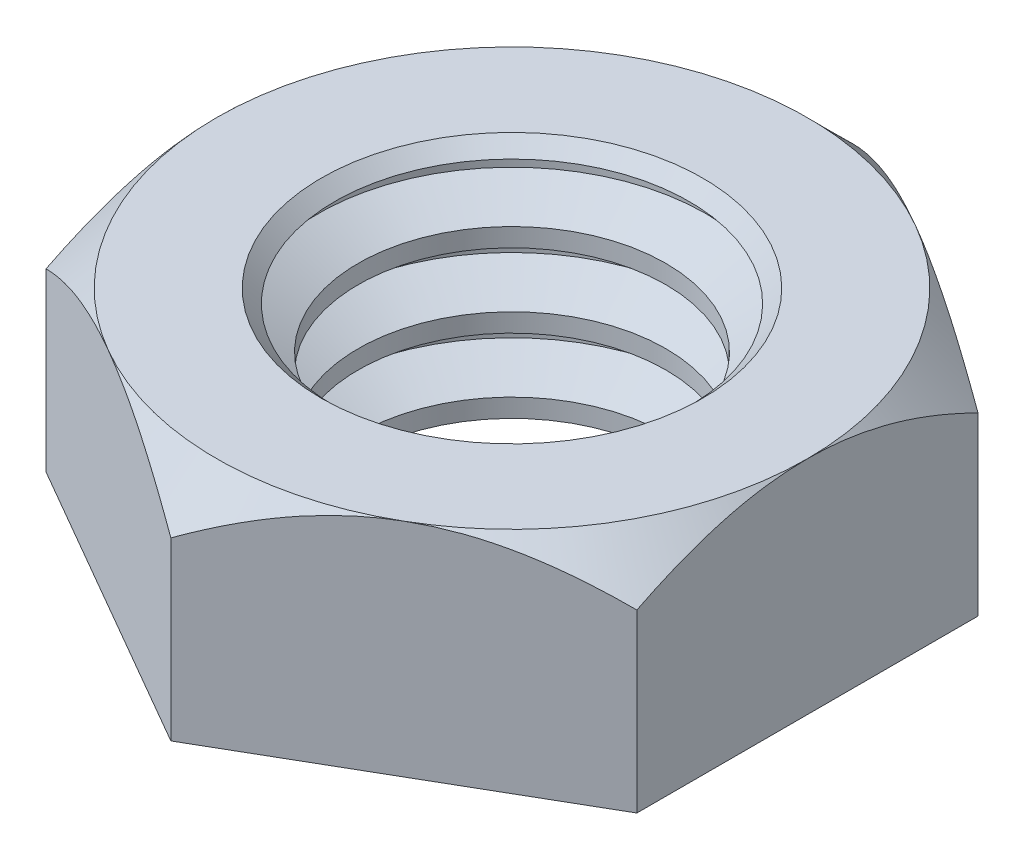
ISO-10303-21;
HEADER;
FILE_DESCRIPTION(('STEP AP214'),'2;1');
FILE_NAME('part.step','',(''),(''),'','','');
FILE_SCHEMA(('AUTOMOTIVE_DESIGN { 1 0 10303 214 1 1 1 1 }'));
ENDSEC;
DATA;
#1=APPLICATION_CONTEXT('core data for automotive mechanical design processes');
#2=APPLICATION_PROTOCOL_DEFINITION('international standard','automotive_design',2000,#1);
#3=PRODUCT_CONTEXT('',#1,'mechanical');
#4=PRODUCT('Part','Part','',(#3));
#5=PRODUCT_RELATED_PRODUCT_CATEGORY('part','',(#4));
#6=PRODUCT_DEFINITION_FORMATION('','',#4);
#7=PRODUCT_DEFINITION_CONTEXT('part definition',#1,'design');
#8=PRODUCT_DEFINITION('design','',#6,#7);
#9=PRODUCT_DEFINITION_SHAPE('','',#8);
#10=(LENGTH_UNIT() NAMED_UNIT(*) SI_UNIT(.MILLI.,.METRE.));
#11=(NAMED_UNIT(*) PLANE_ANGLE_UNIT() SI_UNIT($,.RADIAN.));
#12=(NAMED_UNIT(*) SI_UNIT($,.STERADIAN.) SOLID_ANGLE_UNIT());
#13=UNCERTAINTY_MEASURE_WITH_UNIT(LENGTH_MEASURE(1.E-05),#10,'distance_accuracy_value','');
#14=(GEOMETRIC_REPRESENTATION_CONTEXT(3) GLOBAL_UNCERTAINTY_ASSIGNED_CONTEXT((#13)) GLOBAL_UNIT_ASSIGNED_CONTEXT((#10,
#11,#12)) REPRESENTATION_CONTEXT('',''));
#15=CARTESIAN_POINT('',(0.,0.,0.));
#16=DIRECTION('',(0.,0.,1.));
#17=DIRECTION('',(1.,0.,0.));
#18=AXIS2_PLACEMENT_3D('',#15,#16,#17);
#19=CARTESIAN_POINT('',(-3.175,0.,-5.49926131403119));
#20=DIRECTION('',(0.,1.,0.));
#21=DIRECTION('',(0.,0.,1.));
#22=AXIS2_PLACEMENT_3D('',#19,#20,#21);
#23=PLANE('',#22);
#24=DIRECTION('',(-0.866025403784439,0.,-0.5));
#25=VECTOR('',#24,1.);
#26=CARTESIAN_POINT('',(3.175,0.,-1.83308710467706));
#27=LINE('',#26,#25);
#28=CARTESIAN_POINT('',(3.175,0.,-1.83308710467706));
#29=VERTEX_POINT('',#28);
#30=CARTESIAN_POINT('',(0.,0.,-3.66617420935412));
#31=VERTEX_POINT('',#30);
#32=EDGE_CURVE('E208',#29,#31,#27,.T.);
#33=ORIENTED_EDGE('',*,*,#32,.F.);
#34=DIRECTION('',(0.,0.,-1.));
#35=VECTOR('',#34,1.);
#36=CARTESIAN_POINT('',(3.175,0.,1.83308710467706));
#37=LINE('',#36,#35);
#38=CARTESIAN_POINT('',(3.175,0.,1.83308710467706));
#39=VERTEX_POINT('',#38);
#40=EDGE_CURVE('E282',#39,#29,#37,.T.);
#41=ORIENTED_EDGE('',*,*,#40,.F.);
#42=DIRECTION('',(0.866025403784439,0.,-0.5));
#43=VECTOR('',#42,1.);
#44=CARTESIAN_POINT('',(0.,0.,3.66617420935412));
#45=LINE('',#44,#43);
#46=CARTESIAN_POINT('',(0.,0.,3.66617420935412));
#47=VERTEX_POINT('',#46);
#48=EDGE_CURVE('E280',#47,#39,#45,.T.);
#49=ORIENTED_EDGE('',*,*,#48,.F.);
#50=DIRECTION('',(0.866025403784439,0.,0.5));
#51=VECTOR('',#50,1.);
#52=CARTESIAN_POINT('',(-3.175,0.,1.83308710467706));
#53=LINE('',#52,#51);
#54=CARTESIAN_POINT('',(-3.175,0.,1.83308710467706));
#55=VERTEX_POINT('',#54);
#56=EDGE_CURVE('E126',#55,#47,#53,.T.);
#57=ORIENTED_EDGE('',*,*,#56,.F.);
#58=DIRECTION('',(0.,0.,1.));
#59=VECTOR('',#58,1.);
#60=CARTESIAN_POINT('',(-3.175,0.,-1.83308710467706));
#61=LINE('',#60,#59);
#62=CARTESIAN_POINT('',(-3.175,0.,-1.83308710467706));
#63=VERTEX_POINT('',#62);
#64=EDGE_CURVE('E276',#63,#55,#61,.T.);
#65=ORIENTED_EDGE('',*,*,#64,.F.);
#66=DIRECTION('',(-0.866025403784439,0.,0.5));
#67=VECTOR('',#66,1.);
#68=CARTESIAN_POINT('',(0.,0.,-3.66617420935412));
#69=LINE('',#68,#67);
#70=EDGE_CURVE('E273',#31,#63,#69,.T.);
#71=ORIENTED_EDGE('',*,*,#70,.F.);
#72=EDGE_LOOP('',(#33,#41,#49,#57,#65,#71));
#73=FACE_BOUND('',#72,.T.);
#74=CARTESIAN_POINT('',(0.,0.,0.));
#75=DIRECTION('',(0.,1.,0.));
#76=DIRECTION('',(0.,0.,1.));
#77=AXIS2_PLACEMENT_3D('',#74,#75,#76);
#78=CIRCLE('',#77,1.65317020984131);
#79=CARTESIAN_POINT('',(0.,0.,1.65317020984131));
#80=VERTEX_POINT('',#79);
#81=EDGE_CURVE('E211',#80,#80,#78,.T.);
#82=ORIENTED_EDGE('',*,*,#81,.T.);
#83=EDGE_LOOP('',(#82));
#84=FACE_BOUND('',#83,.T.);
#85=ADVANCED_FACE('F31',(#73,#84),#23,.F.);
#86=CARTESIAN_POINT('',(-3.175,2.38125,-5.49926131403119));
#87=DIRECTION('',(0.,1.,0.));
#88=DIRECTION('',(0.,0.,1.));
#89=AXIS2_PLACEMENT_3D('',#86,#87,#88);
#90=PLANE('',#89);
#91=CARTESIAN_POINT('',(0.,2.38125,0.));
#92=DIRECTION('',(0.,1.,0.));
#93=DIRECTION('',(0.,0.,1.));
#94=AXIS2_PLACEMENT_3D('',#91,#92,#93);
#95=CIRCLE('',#94,2.05004520984131);
#96=CARTESIAN_POINT('',(0.,2.38125,2.05004520984131));
#97=VERTEX_POINT('',#96);
#98=EDGE_CURVE('E11',#97,#97,#95,.F.);
#99=ORIENTED_EDGE('',*,*,#98,.T.);
#100=EDGE_LOOP('',(#99));
#101=FACE_BOUND('',#100,.T.);
#102=CARTESIAN_POINT('',(0.,2.38125,0.));
#103=DIRECTION('',(0.,1.,0.));
#104=DIRECTION('',(0.,0.,1.));
#105=AXIS2_PLACEMENT_3D('',#102,#103,#104);
#106=CIRCLE('',#105,3.175);
#107=CARTESIAN_POINT('',(-1.5875,2.38125,2.74963065701559));
#108=VERTEX_POINT('',#107);
#109=CARTESIAN_POINT('',(1.5875,2.38125,2.74963065701559));
#110=VERTEX_POINT('',#109);
#111=EDGE_CURVE('E110',#108,#110,#106,.T.);
#112=ORIENTED_EDGE('',*,*,#111,.T.);
#113=CARTESIAN_POINT('',(3.175,2.38125,0.));
#114=VERTEX_POINT('',#113);
#115=EDGE_CURVE('E167',#110,#114,#106,.T.);
#116=ORIENTED_EDGE('',*,*,#115,.T.);
#117=CARTESIAN_POINT('',(1.5875,2.38125,-2.74963065701559));
#118=VERTEX_POINT('',#117);
#119=EDGE_CURVE('E250',#114,#118,#106,.T.);
#120=ORIENTED_EDGE('',*,*,#119,.T.);
#121=CARTESIAN_POINT('',(-1.5875,2.38125,-2.74963065701559));
#122=VERTEX_POINT('',#121);
#123=EDGE_CURVE('E252',#118,#122,#106,.T.);
#124=ORIENTED_EDGE('',*,*,#123,.T.);
#125=CARTESIAN_POINT('',(-3.175,2.38125,0.));
#126=VERTEX_POINT('',#125);
#127=EDGE_CURVE('E47',#122,#126,#106,.T.);
#128=ORIENTED_EDGE('',*,*,#127,.T.);
#129=EDGE_CURVE('E55',#126,#108,#106,.T.);
#130=ORIENTED_EDGE('',*,*,#129,.T.);
#131=EDGE_LOOP('',(#112,#116,#120,#124,#128,#130));
#132=FACE_BOUND('',#131,.T.);
#133=ADVANCED_FACE('F157',(#101,#132),#90,.T.);
#134=CARTESIAN_POINT('',(3.175,2.38125,-1.83308710467706));
#135=DIRECTION('',(-0.5,0.,0.866025403784439));
#136=DIRECTION('',(0.866025403784439,0.,0.5));
#137=AXIS2_PLACEMENT_3D('',#134,#135,#136);
#138=PLANE('',#137);
#139=CARTESIAN_POINT('',(3.1752,1.88996031513694,-1.83297163462322));
#140=CARTESIAN_POINT('',(3.06606165005017,1.9529168069541,-1.89598269034567));
#141=CARTESIAN_POINT('',(2.95509837192205,2.01217568641114,-1.9600473688431));
#142=CARTESIAN_POINT('',(2.72883215365405,2.12067713491532,-2.09068223086865));
#143=CARTESIAN_POINT('',(2.61350769674773,2.16985933670717,-2.15726483710766));
#144=CARTESIAN_POINT('',(2.38096147751937,2.25410933177188,-2.29152545937819));
#145=CARTESIAN_POINT('',(2.26379893371884,2.28938887614643,-2.35916928558036));
#146=CARTESIAN_POINT('',(2.02689455535371,2.34374422051106,-2.49594609220167));
#147=CARTESIAN_POINT('',(1.90715995735644,2.36286059311624,-2.56507489458671));
#148=CARTESIAN_POINT('',(1.70080208124841,2.38010866002263,-2.68421566990708));
#149=CARTESIAN_POINT('',(1.61444529227083,2.38266185703206,-2.73407378526963));
#150=CARTESIAN_POINT('',(1.44187218347527,2.37835951752261,-2.83370891608764));
#151=CARTESIAN_POINT('',(1.35565592350718,2.37150068262443,-2.88348589698874));
#152=CARTESIAN_POINT('',(1.18404020841286,2.34876590734217,-2.98256827629562));
#153=CARTESIAN_POINT('',(1.09864177574671,2.3328798809586,-3.03187308438379));
#154=CARTESIAN_POINT('',(0.929311596694508,2.29295780664792,-3.12963590884151));
#155=CARTESIAN_POINT('',(0.845379738380232,2.2689223835607,-3.17809398983284));
#156=CARTESIAN_POINT('',(0.696376420715866,2.21947055622871,-3.26412109539651));
#157=CARTESIAN_POINT('',(0.63097514880825,2.19535407134489,-3.30188053733772));
#158=CARTESIAN_POINT('',(0.501346749794879,2.14323432350872,-3.37672152840271));
#159=CARTESIAN_POINT('',(0.437119658558264,2.11523094204235,-3.41380305681743));
#160=CARTESIAN_POINT('',(0.310041965487391,2.05596522510137,-3.4871713971199));
#161=CARTESIAN_POINT('',(0.247187749251269,2.02471313729167,-3.52346029578353));
#162=CARTESIAN_POINT('',(0.122643379151903,1.95936044625395,-3.59536602138645));
#163=CARTESIAN_POINT('',(0.0609525390212882,1.92526159112734,-3.63098324454239));
#164=CARTESIAN_POINT('',(-0.000200000000000332,1.88996031513694,-3.66628967940796));
#165=B_SPLINE_CURVE_WITH_KNOTS('',3,(#139,#140,#141,#142,#143,#144,#145,#146,#147,#148,#149,
#150,#151,#152,#153,#154,#155,#156,#157,#158,#159,#160,#161,#162,#163,#164),.UNSPECIFIED.,.F.,
.F.,(4,2,2,2,2,2,2,2,2,2,2,2,4),(0.,0.422910572436811,0.848285055427813,1.26690402276128,
1.68446903107507,1.98329272958353,2.28222117546892,2.58148426995467,2.88072442418454,
3.11844134429548,3.35616551414406,3.59316134346767,3.83001269744429),.UNSPECIFIED.);
#166=CARTESIAN_POINT('',(3.175,1.89007579064588,-1.83308710467706));
#167=VERTEX_POINT('',#166);
#168=EDGE_CURVE('E264',#167,#118,#165,.T.);
#169=ORIENTED_EDGE('',*,*,#168,.F.);
#170=DIRECTION('',(0.,-1.,0.));
#171=VECTOR('',#170,1.);
#172=CARTESIAN_POINT('',(3.175,2.38125,-1.83308710467706));
#173=LINE('',#172,#171);
#174=EDGE_CURVE('E133',#167,#29,#173,.T.);
#175=ORIENTED_EDGE('',*,*,#174,.T.);
#176=ORIENTED_EDGE('',*,*,#32,.T.);
#177=DIRECTION('',(0.,-1.,0.));
#178=VECTOR('',#177,1.);
#179=CARTESIAN_POINT('',(0.,2.38125,-3.66617420935412));
#180=LINE('',#179,#178);
#181=CARTESIAN_POINT('',(0.,1.89007579064588,-3.66617420935412));
#182=VERTEX_POINT('',#181);
#183=EDGE_CURVE('E138',#182,#31,#180,.T.);
#184=ORIENTED_EDGE('',*,*,#183,.F.);
#185=EDGE_CURVE('E259',#118,#182,#165,.T.);
#186=ORIENTED_EDGE('',*,*,#185,.F.);
#187=EDGE_LOOP('',(#169,#175,#176,#184,#186));
#188=FACE_BOUND('',#187,.T.);
#189=ADVANCED_FACE('F33',(#188),#138,.F.);
#190=CARTESIAN_POINT('',(0.,2.38125,-3.66617420935412));
#191=DIRECTION('',(0.5,0.,0.866025403784439));
#192=DIRECTION('',(0.866025403784439,0.,-0.5));
#193=AXIS2_PLACEMENT_3D('',#190,#191,#192);
#194=PLANE('',#193);
#195=CARTESIAN_POINT('',(0.000199999999999625,1.88996031513694,-3.66628967940796));
#196=CARTESIAN_POINT('',(-0.108938349949827,1.9529168069541,-3.60327862368552));
#197=CARTESIAN_POINT('',(-0.219901628077947,2.01217568641114,-3.53921394518808));
#198=CARTESIAN_POINT('',(-0.446167846345949,2.12067713491532,-3.40857908316253));
#199=CARTESIAN_POINT('',(-0.561492303252266,2.16985933670717,-3.34199647692353));
#200=CARTESIAN_POINT('',(-0.79403852248063,2.25410933177188,-3.207735854653));
#201=CARTESIAN_POINT('',(-0.911201066281155,2.28938887614643,-3.14009202845083));
#202=CARTESIAN_POINT('',(-1.14810544464629,2.34374422051106,-3.00331522182952));
#203=CARTESIAN_POINT('',(-1.26784004264356,2.36286059311624,-2.93418641944448));
#204=CARTESIAN_POINT('',(-1.47419791875159,2.38010866002263,-2.81504564412411));
#205=CARTESIAN_POINT('',(-1.56055470772916,2.38266185703206,-2.76518752876155));
#206=CARTESIAN_POINT('',(-1.73312781652473,2.37835951752261,-2.66555239794355));
#207=CARTESIAN_POINT('',(-1.81934407649282,2.37150068262443,-2.61577541704245));
#208=CARTESIAN_POINT('',(-1.99095979158714,2.34876590734217,-2.51669303773557));
#209=CARTESIAN_POINT('',(-2.07635822425329,2.3328798809586,-2.4673882296474));
#210=CARTESIAN_POINT('',(-2.24568840330549,2.29295780664792,-2.36962540518968));
#211=CARTESIAN_POINT('',(-2.32962026161976,2.2689223835607,-2.32116732419835));
#212=CARTESIAN_POINT('',(-2.47862357928413,2.21947055622871,-2.23514021863468));
#213=CARTESIAN_POINT('',(-2.54402485119175,2.19535407134489,-2.19738077669347));
#214=CARTESIAN_POINT('',(-2.67365325020512,2.14323432350872,-2.12253978562848));
#215=CARTESIAN_POINT('',(-2.73788034144173,2.11523094204235,-2.08545825721375));
#216=CARTESIAN_POINT('',(-2.86495803451261,2.05596522510137,-2.01208991691129));
#217=CARTESIAN_POINT('',(-2.92781225074873,2.02471313729167,-1.97580101824766));
#218=CARTESIAN_POINT('',(-3.0523566208481,1.95936044625395,-1.90389529264474));
#219=CARTESIAN_POINT('',(-3.11404746097871,1.92526159112734,-1.86827806948879));
#220=CARTESIAN_POINT('',(-3.1752,1.88996031513694,-1.83297163462322));
#221=B_SPLINE_CURVE_WITH_KNOTS('',3,(#195,#196,#197,#198,#199,#200,#201,#202,#203,#204,#205,
#206,#207,#208,#209,#210,#211,#212,#213,#214,#215,#216,#217,#218,#219,#220),.UNSPECIFIED.,.F.,
.F.,(4,2,2,2,2,2,2,2,2,2,2,2,4),(0.,0.42291057243681,0.848285055427811,1.26690402276128,
1.68446903107507,1.98329272958353,2.28222117546891,2.58148426995467,2.88072442418454,
3.11844134429547,3.35616551414406,3.59316134346767,3.83001269744429),.UNSPECIFIED.);
#222=EDGE_CURVE('E260',#182,#122,#221,.T.);
#223=ORIENTED_EDGE('',*,*,#222,.F.);
#224=ORIENTED_EDGE('',*,*,#183,.T.);
#225=ORIENTED_EDGE('',*,*,#70,.T.);
#226=DIRECTION('',(0.,-1.,0.));
#227=VECTOR('',#226,1.);
#228=CARTESIAN_POINT('',(-3.175,2.38125,-1.83308710467706));
#229=LINE('',#228,#227);
#230=CARTESIAN_POINT('',(-3.175,1.89007579064588,-1.83308710467706));
#231=VERTEX_POINT('',#230);
#232=EDGE_CURVE('E131',#231,#63,#229,.T.);
#233=ORIENTED_EDGE('',*,*,#232,.F.);
#234=EDGE_CURVE('E179',#122,#231,#221,.T.);
#235=ORIENTED_EDGE('',*,*,#234,.F.);
#236=EDGE_LOOP('',(#223,#224,#225,#233,#235));
#237=FACE_BOUND('',#236,.T.);
#238=ADVANCED_FACE('F187',(#237),#194,.F.);
#239=CARTESIAN_POINT('',(-3.175,2.38125,-1.83308710467706));
#240=DIRECTION('',(1.,0.,0.));
#241=DIRECTION('',(0.,0.,-1.));
#242=AXIS2_PLACEMENT_3D('',#239,#240,#241);
#243=PLANE('',#242);
#244=CARTESIAN_POINT('',(-3.175,0.584822785208259,-3.82550173859223));
#245=CARTESIAN_POINT('',(-3.175,0.655925585336682,-3.73307940798676));
#246=CARTESIAN_POINT('',(-3.175,0.726391251428477,-3.64015908864777));
#247=CARTESIAN_POINT('',(-3.175,0.865757232183779,-3.45311892815607));
#248=CARTESIAN_POINT('',(-3.175,0.934657172560595,-3.35899880841265));
#249=CARTESIAN_POINT('',(-3.175,1.0710909411336,-3.1686677001203));
#250=CARTESIAN_POINT('',(-3.175,1.13861012923271,-3.07244618278618));
#251=CARTESIAN_POINT('',(-3.175,1.27129881964192,-2.87840174032636));
#252=CARTESIAN_POINT('',(-3.175,1.33646848374207,-2.78057892614431));
#253=CARTESIAN_POINT('',(-3.175,1.46796383575676,-2.57680028067135));
#254=CARTESIAN_POINT('',(-3.175,1.53410080280131,-2.47072205646737));
#255=CARTESIAN_POINT('',(-3.175,1.66226971880863,-2.25607452473044));
#256=CARTESIAN_POINT('',(-3.175,1.72430097693437,-2.14750480208963));
#257=CARTESIAN_POINT('',(-3.175,1.84293743313151,-1.92784457321091));
#258=CARTESIAN_POINT('',(-3.175,1.89955855943246,-1.81676273746668));
#259=CARTESIAN_POINT('',(-3.175,2.00610616778317,-1.59145888895421));
#260=CARTESIAN_POINT('',(-3.175,2.05603580799489,-1.47723838842518));
#261=CARTESIAN_POINT('',(-3.175,2.14288269729627,-1.25684671901497));
#262=CARTESIAN_POINT('',(-3.175,2.18059773317089,-1.15099315251884));
#263=CARTESIAN_POINT('',(-3.175,2.24755487723131,-0.936589189159993));
#264=CARTESIAN_POINT('',(-3.175,2.27679644574013,-0.82803862100249));
#265=CARTESIAN_POINT('',(-3.175,2.32473642477786,-0.610779530448622));
#266=CARTESIAN_POINT('',(-3.175,2.3436263258239,-0.502113984096));
#267=CARTESIAN_POINT('',(-3.175,2.37046889148738,-0.283432812868507));
#268=CARTESIAN_POINT('',(-3.175,2.37842382527095,-0.173417472877855));
#269=CARTESIAN_POINT('',(-3.175,2.38271883985823,0.0420296197405056));
#270=CARTESIAN_POINT('',(-3.175,2.37955114343981,0.147451651268774));
#271=CARTESIAN_POINT('',(-3.175,2.36290576781609,0.357473049770711));
#272=CARTESIAN_POINT('',(-3.175,2.34942715214056,0.462072341148698));
#273=CARTESIAN_POINT('',(-3.175,2.31269295947987,0.671463950248097));
#274=CARTESIAN_POINT('',(-3.175,2.28926476865051,0.776225468212737));
#275=CARTESIAN_POINT('',(-3.175,2.23393119167781,0.983441469790901));
#276=CARTESIAN_POINT('',(-3.175,2.20202628700164,1.08589608407538));
#277=CARTESIAN_POINT('',(-3.175,2.12909578890773,1.29414958797407));
#278=CARTESIAN_POINT('',(-3.175,2.08764961660714,1.39979950434554));
#279=CARTESIAN_POINT('',(-3.175,1.99835966586789,1.60836801217217));
#280=CARTESIAN_POINT('',(-3.175,1.9505138347867,1.71128571454394));
#281=CARTESIAN_POINT('',(-3.175,1.84955101498201,1.91489794191469));
#282=CARTESIAN_POINT('',(-3.175,1.79641741110329,2.01558416077798));
#283=CARTESIAN_POINT('',(-3.175,1.68605260265228,2.21464722678952));
#284=CARTESIAN_POINT('',(-3.175,1.62882211870532,2.31302447605394));
#285=CARTESIAN_POINT('',(-3.175,1.5139694683133,2.50296629362351));
#286=CARTESIAN_POINT('',(-3.175,1.45650613900039,2.59462741653024));
#287=CARTESIAN_POINT('',(-3.175,1.33913355187806,2.77637485513201));
#288=CARTESIAN_POINT('',(-3.175,1.27922411068686,2.86646105203119));
#289=CARTESIAN_POINT('',(-3.175,1.15788321689263,3.04454040024692));
#290=CARTESIAN_POINT('',(-3.175,1.09646784628761,3.13254454916012));
#291=CARTESIAN_POINT('',(-3.175,0.971990775193127,3.30734554963437));
#292=CARTESIAN_POINT('',(-3.175,0.908929533206286,3.39414272731757));
#293=CARTESIAN_POINT('',(-3.175,0.845194593523936,3.48043359983889));
#294=B_SPLINE_CURVE_WITH_KNOTS('',3,(#244,#245,#246,#247,#248,#249,#250,#251,#252,#253,#254,
#255,#256,#257,#258,#259,#260,#261,#262,#263,#264,#265,#266,#267,#268,#269,#270,#271,#272,#273,
#274,#275,#276,#277,#278,#279,#280,#281,#282,#283,#284,#285,#286,#287,#288,#289,#290,#291,#292,
#293),.UNSPECIFIED.,.F.,.F.,(4,2,2,2,2,2,2,2,2,2,2,2,2,2,2,2,2,2,2,2,2,2,2,2,4),(0.,
0.349831314768782,0.699745395229552,1.05235899551762,1.40494826800023,1.77989464709327,
2.15490395606881,2.52877277065645,2.90246450530056,3.23928909169294,3.57613512580378,
3.90651938348529,4.2368350712314,4.55272064725242,4.86863491640524,5.19026949798562,
5.51188581501123,5.85209109665958,6.19240575943865,6.53382570832689,6.87518574963577,
7.19969248624715,7.52422359553222,7.84614908167089,8.16798582420524),.UNSPECIFIED.);
#295=EDGE_CURVE('E178',#231,#126,#294,.T.);
#296=ORIENTED_EDGE('',*,*,#295,.F.);
#297=ORIENTED_EDGE('',*,*,#232,.T.);
#298=ORIENTED_EDGE('',*,*,#64,.T.);
#299=DIRECTION('',(0.,-1.,0.));
#300=VECTOR('',#299,1.);
#301=CARTESIAN_POINT('',(-3.175,2.38125,1.83308710467706));
#302=LINE('',#301,#300);
#303=CARTESIAN_POINT('',(-3.175,1.89007579064588,1.83308710467706));
#304=VERTEX_POINT('',#303);
#305=EDGE_CURVE('E128',#304,#55,#302,.T.);
#306=ORIENTED_EDGE('',*,*,#305,.F.);
#307=EDGE_CURVE('E173',#126,#304,#294,.T.);
#308=ORIENTED_EDGE('',*,*,#307,.F.);
#309=EDGE_LOOP('',(#296,#297,#298,#306,#308));
#310=FACE_BOUND('',#309,.T.);
#311=ADVANCED_FACE('F184',(#310),#243,.F.);
#312=CARTESIAN_POINT('',(-3.175,2.38125,1.83308710467706));
#313=DIRECTION('',(0.5,0.,-0.866025403784439));
#314=DIRECTION('',(-0.866025403784439,0.,-0.5));
#315=AXIS2_PLACEMENT_3D('',#312,#313,#314);
#316=PLANE('',#315);
#317=CARTESIAN_POINT('',(-3.1752,1.88996031513694,1.83297163462322));
#318=CARTESIAN_POINT('',(-3.06606165005017,1.9529168069541,1.89598269034567));
#319=CARTESIAN_POINT('',(-2.95509837192205,2.01217568641114,1.9600473688431));
#320=CARTESIAN_POINT('',(-2.72883215365405,2.12067713491532,2.09068223086865));
#321=CARTESIAN_POINT('',(-2.61350769674774,2.16985933670717,2.15726483710766));
#322=CARTESIAN_POINT('',(-2.38096147751937,2.25410933177188,2.29152545937819));
#323=CARTESIAN_POINT('',(-2.26379893371885,2.28938887614643,2.35916928558036));
#324=CARTESIAN_POINT('',(-2.02689455535371,2.34374422051106,2.49594609220167));
#325=CARTESIAN_POINT('',(-1.90715995735644,2.36286059311624,2.56507489458671));
#326=CARTESIAN_POINT('',(-1.70080208124841,2.38010866002263,2.68421566990708));
#327=CARTESIAN_POINT('',(-1.61444529227084,2.38266185703206,2.73407378526963));
#328=CARTESIAN_POINT('',(-1.44187218347527,2.37835951752261,2.83370891608764));
#329=CARTESIAN_POINT('',(-1.35565592350719,2.37150068262443,2.88348589698874));
#330=CARTESIAN_POINT('',(-1.18404020841286,2.34876590734217,2.98256827629562));
#331=CARTESIAN_POINT('',(-1.09864177574671,2.33287988095859,3.03187308438379));
#332=CARTESIAN_POINT('',(-0.92931159669451,2.29295780664792,3.12963590884151));
#333=CARTESIAN_POINT('',(-0.845379738380235,2.2689223835607,3.17809398983284));
#334=CARTESIAN_POINT('',(-0.696376420715868,2.21947055622871,3.26412109539651));
#335=CARTESIAN_POINT('',(-0.630975148808253,2.19535407134488,3.30188053733772));
#336=CARTESIAN_POINT('',(-0.501346749794881,2.14323432350872,3.37672152840271));
#337=CARTESIAN_POINT('',(-0.437119658558266,2.11523094204235,3.41380305681743));
#338=CARTESIAN_POINT('',(-0.310041965487392,2.05596522510137,3.4871713971199));
#339=CARTESIAN_POINT('',(-0.24718774925127,2.02471313729167,3.52346029578353));
#340=CARTESIAN_POINT('',(-0.122643379151904,1.95936044625395,3.59536602138645));
#341=CARTESIAN_POINT('',(-0.0609525390212895,1.92526159112733,3.63098324454239));
#342=CARTESIAN_POINT('',(0.000199999999999559,1.88996031513694,3.66628967940796));
#343=B_SPLINE_CURVE_WITH_KNOTS('',3,(#317,#318,#319,#320,#321,#322,#323,#324,#325,#326,#327,
#328,#329,#330,#331,#332,#333,#334,#335,#336,#337,#338,#339,#340,#341,#342),.UNSPECIFIED.,.F.,
.F.,(4,2,2,2,2,2,2,2,2,2,2,2,4),(0.,0.42291057243681,0.848285055427811,1.26690402276128,
1.68446903107507,1.98329272958353,2.28222117546892,2.58148426995467,2.88072442418454,
3.11844134429547,3.35616551414406,3.59316134346767,3.83001269744429),.UNSPECIFIED.);
#344=EDGE_CURVE('E114',#304,#108,#343,.T.);
#345=ORIENTED_EDGE('',*,*,#344,.F.);
#346=ORIENTED_EDGE('',*,*,#305,.T.);
#347=ORIENTED_EDGE('',*,*,#56,.T.);
#348=DIRECTION('',(0.,-1.,0.));
#349=VECTOR('',#348,1.);
#350=CARTESIAN_POINT('',(0.,2.38125,3.66617420935412));
#351=LINE('',#350,#349);
#352=CARTESIAN_POINT('',(0.,1.89007579064588,3.66617420935412));
#353=VERTEX_POINT('',#352);
#354=EDGE_CURVE('E119',#353,#47,#351,.T.);
#355=ORIENTED_EDGE('',*,*,#354,.F.);
#356=EDGE_CURVE('E104',#108,#353,#343,.T.);
#357=ORIENTED_EDGE('',*,*,#356,.F.);
#358=EDGE_LOOP('',(#345,#346,#347,#355,#357));
#359=FACE_BOUND('',#358,.T.);
#360=ADVANCED_FACE('F124',(#359),#316,.F.);
#361=CARTESIAN_POINT('',(0.,2.38125,3.66617420935412));
#362=DIRECTION('',(-0.5,0.,-0.866025403784439));
#363=DIRECTION('',(-0.866025403784439,0.,0.5));
#364=AXIS2_PLACEMENT_3D('',#361,#362,#363);
#365=PLANE('',#364);
#366=CARTESIAN_POINT('',(-0.000200000000000897,1.88996031513694,3.66628967940796));
#367=CARTESIAN_POINT('',(0.108938349949826,1.9529168069541,3.60327862368552));
#368=CARTESIAN_POINT('',(0.219901628077946,2.01217568641114,3.53921394518809));
#369=CARTESIAN_POINT('',(0.446167846345949,2.12067713491532,3.40857908316253));
#370=CARTESIAN_POINT('',(0.561492303252266,2.16985933670717,3.34199647692353));
#371=CARTESIAN_POINT('',(0.79403852248063,2.25410933177188,3.207735854653));
#372=CARTESIAN_POINT('',(0.911201066281155,2.28938887614643,3.14009202845083));
#373=CARTESIAN_POINT('',(1.14810544464629,2.34374422051106,3.00331522182952));
#374=CARTESIAN_POINT('',(1.26784004264356,2.36286059311624,2.93418641944448));
#375=CARTESIAN_POINT('',(1.47419791875159,2.38010866002263,2.81504564412411));
#376=CARTESIAN_POINT('',(1.56055470772916,2.38266185703206,2.76518752876155));
#377=CARTESIAN_POINT('',(1.73312781652473,2.37835951752261,2.66555239794355));
#378=CARTESIAN_POINT('',(1.81934407649282,2.37150068262443,2.61577541704245));
#379=CARTESIAN_POINT('',(1.99095979158714,2.34876590734217,2.51669303773557));
#380=CARTESIAN_POINT('',(2.07635822425329,2.3328798809586,2.4673882296474));
#381=CARTESIAN_POINT('',(2.24568840330549,2.29295780664792,2.36962540518968));
#382=CARTESIAN_POINT('',(2.32962026161977,2.2689223835607,2.32116732419835));
#383=CARTESIAN_POINT('',(2.47862357928413,2.21947055622871,2.23514021863468));
#384=CARTESIAN_POINT('',(2.54402485119175,2.19535407134488,2.19738077669347));
#385=CARTESIAN_POINT('',(2.67365325020512,2.14323432350872,2.12253978562848));
#386=CARTESIAN_POINT('',(2.73788034144173,2.11523094204235,2.08545825721375));
#387=CARTESIAN_POINT('',(2.86495803451261,2.05596522510137,2.01208991691129));
#388=CARTESIAN_POINT('',(2.92781225074873,2.02471313729167,1.97580101824766));
#389=CARTESIAN_POINT('',(3.0523566208481,1.95936044625395,1.90389529264474));
#390=CARTESIAN_POINT('',(3.11404746097871,1.92526159112733,1.8682780694888));
#391=CARTESIAN_POINT('',(3.1752,1.88996031513694,1.83297163462322));
#392=B_SPLINE_CURVE_WITH_KNOTS('',3,(#366,#367,#368,#369,#370,#371,#372,#373,#374,#375,#376,
#377,#378,#379,#380,#381,#382,#383,#384,#385,#386,#387,#388,#389,#390,#391),.UNSPECIFIED.,.F.,
.F.,(4,2,2,2,2,2,2,2,2,2,2,2,4),(0.,0.422910572436811,0.848285055427812,1.26690402276128,
1.68446903107507,1.98329272958353,2.28222117546892,2.58148426995467,2.88072442418454,
3.11844134429548,3.35616551414406,3.59316134346767,3.8300126974443),.UNSPECIFIED.);
#393=EDGE_CURVE('E107',#353,#110,#392,.T.);
#394=ORIENTED_EDGE('',*,*,#393,.F.);
#395=ORIENTED_EDGE('',*,*,#354,.T.);
#396=ORIENTED_EDGE('',*,*,#48,.T.);
#397=DIRECTION('',(0.,-1.,0.));
#398=VECTOR('',#397,1.);
#399=CARTESIAN_POINT('',(3.175,2.38125,1.83308710467706));
#400=LINE('',#399,#398);
#401=CARTESIAN_POINT('',(3.175,1.89007579064588,1.83308710467706));
#402=VERTEX_POINT('',#401);
#403=EDGE_CURVE('E129',#402,#39,#400,.T.);
#404=ORIENTED_EDGE('',*,*,#403,.F.);
#405=EDGE_CURVE('E122',#110,#402,#392,.T.);
#406=ORIENTED_EDGE('',*,*,#405,.F.);
#407=EDGE_LOOP('',(#394,#395,#396,#404,#406));
#408=FACE_BOUND('',#407,.T.);
#409=ADVANCED_FACE('F117',(#408),#365,.F.);
#410=CARTESIAN_POINT('',(3.175,2.38125,1.83308710467706));
#411=DIRECTION('',(-1.,0.,0.));
#412=DIRECTION('',(0.,0.,1.));
#413=AXIS2_PLACEMENT_3D('',#410,#411,#412);
#414=PLANE('',#413);
#415=CARTESIAN_POINT('',(3.175,0.584822785208259,-3.82550173859223));
#416=CARTESIAN_POINT('',(3.175,0.655925585336684,-3.73307940798676));
#417=CARTESIAN_POINT('',(3.175,0.726391251428478,-3.64015908864777));
#418=CARTESIAN_POINT('',(3.175,0.865757232183779,-3.45311892815607));
#419=CARTESIAN_POINT('',(3.175,0.934657172560595,-3.35899880841265));
#420=CARTESIAN_POINT('',(3.175,1.0710909411336,-3.1686677001203));
#421=CARTESIAN_POINT('',(3.175,1.13861012923271,-3.07244618278618));
#422=CARTESIAN_POINT('',(3.175,1.27129881964192,-2.87840174032636));
#423=CARTESIAN_POINT('',(3.175,1.33646848374207,-2.78057892614431));
#424=CARTESIAN_POINT('',(3.175,1.46796383575676,-2.57680028067135));
#425=CARTESIAN_POINT('',(3.175,1.53410080280131,-2.47072205646737));
#426=CARTESIAN_POINT('',(3.175,1.66226971880863,-2.25607452473044));
#427=CARTESIAN_POINT('',(3.175,1.72430097693437,-2.14750480208963));
#428=CARTESIAN_POINT('',(3.175,1.84293743313151,-1.92784457321091));
#429=CARTESIAN_POINT('',(3.175,1.89955855943246,-1.81676273746668));
#430=CARTESIAN_POINT('',(3.175,2.00610616778317,-1.59145888895421));
#431=CARTESIAN_POINT('',(3.175,2.05603580799489,-1.47723838842518));
#432=CARTESIAN_POINT('',(3.175,2.14288269729627,-1.25684671901497));
#433=CARTESIAN_POINT('',(3.175,2.18059773317089,-1.15099315251884));
#434=CARTESIAN_POINT('',(3.175,2.24755487723131,-0.936589189159993));
#435=CARTESIAN_POINT('',(3.175,2.27679644574013,-0.82803862100249));
#436=CARTESIAN_POINT('',(3.175,2.32473642477786,-0.610779530448622));
#437=CARTESIAN_POINT('',(3.175,2.3436263258239,-0.502113984096));
#438=CARTESIAN_POINT('',(3.175,2.37046889148738,-0.283432812868507));
#439=CARTESIAN_POINT('',(3.175,2.37842382527095,-0.173417472877856));
#440=CARTESIAN_POINT('',(3.175,2.38271883985823,0.0420296197405055));
#441=CARTESIAN_POINT('',(3.175,2.37955114343981,0.147451651268774));
#442=CARTESIAN_POINT('',(3.175,2.36290576781609,0.357473049770711));
#443=CARTESIAN_POINT('',(3.175,2.34942715214056,0.462072341148698));
#444=CARTESIAN_POINT('',(3.175,2.31269295947987,0.671463950248097));
#445=CARTESIAN_POINT('',(3.175,2.28926476865051,0.776225468212737));
#446=CARTESIAN_POINT('',(3.175,2.23393119167781,0.9834414697909));
#447=CARTESIAN_POINT('',(3.175,2.20202628700164,1.08589608407538));
#448=CARTESIAN_POINT('',(3.175,2.12909578890773,1.29414958797407));
#449=CARTESIAN_POINT('',(3.175,2.08764961660714,1.39979950434554));
#450=CARTESIAN_POINT('',(3.175,1.99835966586789,1.60836801217217));
#451=CARTESIAN_POINT('',(3.175,1.9505138347867,1.71128571454393));
#452=CARTESIAN_POINT('',(3.175,1.84955101498201,1.91489794191469));
#453=CARTESIAN_POINT('',(3.175,1.79641741110329,2.01558416077798));
#454=CARTESIAN_POINT('',(3.175,1.68605260265228,2.21464722678952));
#455=CARTESIAN_POINT('',(3.175,1.62882211870532,2.31302447605393));
#456=CARTESIAN_POINT('',(3.175,1.51396946831331,2.50296629362351));
#457=CARTESIAN_POINT('',(3.175,1.45650613900039,2.59462741653024));
#458=CARTESIAN_POINT('',(3.175,1.33913355187806,2.77637485513201));
#459=CARTESIAN_POINT('',(3.175,1.27922411068686,2.86646105203119));
#460=CARTESIAN_POINT('',(3.175,1.15788321689263,3.04454040024692));
#461=CARTESIAN_POINT('',(3.175,1.09646784628762,3.13254454916012));
#462=CARTESIAN_POINT('',(3.175,0.971990775193128,3.30734554963437));
#463=CARTESIAN_POINT('',(3.175,0.908929533206287,3.39414272731757));
#464=CARTESIAN_POINT('',(3.175,0.845194593523937,3.48043359983889));
#465=B_SPLINE_CURVE_WITH_KNOTS('',3,(#415,#416,#417,#418,#419,#420,#421,#422,#423,#424,#425,
#426,#427,#428,#429,#430,#431,#432,#433,#434,#435,#436,#437,#438,#439,#440,#441,#442,#443,#444,
#445,#446,#447,#448,#449,#450,#451,#452,#453,#454,#455,#456,#457,#458,#459,#460,#461,#462,#463,
#464),.UNSPECIFIED.,.F.,.F.,(4,2,2,2,2,2,2,2,2,2,2,2,2,2,2,2,2,2,2,2,2,2,2,2,4),(0.,
0.349831314768782,0.699745395229552,1.05235899551762,1.40494826800023,1.77989464709327,
2.1549039560688,2.52877277065645,2.90246450530056,3.23928909169294,3.57613512580378,
3.90651938348529,4.23683507123139,4.55272064725242,4.86863491640524,5.19026949798562,
5.51188581501123,5.85209109665958,6.19240575943865,6.53382570832689,6.87518574963577,
7.19969248624715,7.52422359553222,7.8461490816709,8.16798582420524),.UNSPECIFIED.);
#466=EDGE_CURVE('E146',#402,#114,#465,.F.);
#467=ORIENTED_EDGE('',*,*,#466,.F.);
#468=ORIENTED_EDGE('',*,*,#403,.T.);
#469=ORIENTED_EDGE('',*,*,#40,.T.);
#470=ORIENTED_EDGE('',*,*,#174,.F.);
#471=EDGE_CURVE('E140',#114,#167,#465,.F.);
#472=ORIENTED_EDGE('',*,*,#471,.F.);
#473=EDGE_LOOP('',(#467,#468,#469,#470,#472));
#474=FACE_BOUND('',#473,.T.);
#475=ADVANCED_FACE('F151',(#474),#414,.F.);
#476=CARTESIAN_POINT('',(0.,2.38125,0.));
#477=DIRECTION('',(0.,-1.,0.));
#478=DIRECTION('',(0.,0.,-1.));
#479=AXIS2_PLACEMENT_3D('',#476,#477,#478);
#480=CONICAL_SURFACE('',#479,3.175,0.785398163397454);
#481=ORIENTED_EDGE('',*,*,#168,.T.);
#482=ORIENTED_EDGE('',*,*,#119,.F.);
#483=ORIENTED_EDGE('',*,*,#471,.T.);
#484=EDGE_LOOP('',(#481,#482,#483));
#485=FACE_BOUND('',#484,.T.);
#486=ADVANCED_FACE('F147',(#485),#480,.T.);
#487=ORIENTED_EDGE('',*,*,#356,.T.);
#488=ORIENTED_EDGE('',*,*,#393,.T.);
#489=ORIENTED_EDGE('',*,*,#111,.F.);
#490=EDGE_LOOP('',(#487,#488,#489));
#491=FACE_BOUND('',#490,.T.);
#492=ADVANCED_FACE('F106',(#491),#480,.T.);
#493=ORIENTED_EDGE('',*,*,#307,.T.);
#494=ORIENTED_EDGE('',*,*,#344,.T.);
#495=ORIENTED_EDGE('',*,*,#129,.F.);
#496=EDGE_LOOP('',(#493,#494,#495));
#497=FACE_BOUND('',#496,.T.);
#498=ADVANCED_FACE('F291',(#497),#480,.T.);
#499=ORIENTED_EDGE('',*,*,#234,.T.);
#500=ORIENTED_EDGE('',*,*,#295,.T.);
#501=ORIENTED_EDGE('',*,*,#127,.F.);
#502=EDGE_LOOP('',(#499,#500,#501));
#503=FACE_BOUND('',#502,.T.);
#504=ADVANCED_FACE('F290',(#503),#480,.T.);
#505=ORIENTED_EDGE('',*,*,#185,.T.);
#506=ORIENTED_EDGE('',*,*,#222,.T.);
#507=ORIENTED_EDGE('',*,*,#123,.F.);
#508=EDGE_LOOP('',(#505,#506,#507));
#509=FACE_BOUND('',#508,.T.);
#510=ADVANCED_FACE('F257',(#509),#480,.T.);
#511=ORIENTED_EDGE('',*,*,#405,.T.);
#512=ORIENTED_EDGE('',*,*,#466,.T.);
#513=ORIENTED_EDGE('',*,*,#115,.F.);
#514=EDGE_LOOP('',(#511,#512,#513));
#515=FACE_BOUND('',#514,.T.);
#516=ADVANCED_FACE('F297',(#515),#480,.T.);
#517=CARTESIAN_POINT('',(0.,2.133203125,0.));
#518=DIRECTION('',(0.,-1.,0.));
#519=DIRECTION('',(0.,0.,-1.));
#520=AXIS2_PLACEMENT_3D('',#517,#518,#519);
#521=CONICAL_SURFACE('',#520,2.0828,1.0471975511966);
#522=CARTESIAN_POINT('',(0.,2.23598366787305,0.));
#523=DIRECTION('',(0.,1.,0.));
#524=DIRECTION('',(0.,0.,1.));
#525=AXIS2_PLACEMENT_3D('',#522,#523,#524);
#526=CIRCLE('',#525,1.90477887771436);
#527=CARTESIAN_POINT('',(0.,2.23598366787305,1.90477887771436));
#528=VERTEX_POINT('',#527);
#529=EDGE_CURVE('E40',#528,#528,#526,.T.);
#530=ORIENTED_EDGE('',*,*,#529,.T.);
#531=EDGE_LOOP('',(#530));
#532=FACE_BOUND('',#531,.T.);
#533=CARTESIAN_POINT('',(0.,2.133203125,0.));
#534=DIRECTION('',(0.,1.,0.));
#535=DIRECTION('',(0.,0.,1.));
#536=AXIS2_PLACEMENT_3D('',#533,#534,#535);
#537=CIRCLE('',#536,2.0828);
#538=CARTESIAN_POINT('',(0.,2.133203125,2.0828));
#539=VERTEX_POINT('',#538);
#540=EDGE_CURVE('E244',#539,#539,#537,.T.);
#541=ORIENTED_EDGE('',*,*,#540,.F.);
#542=EDGE_LOOP('',(#541));
#543=FACE_BOUND('',#542,.T.);
#544=ADVANCED_FACE('F302',(#532,#543),#521,.F.);
#545=CARTESIAN_POINT('',(0.,1.66357854098429,0.));
#546=DIRECTION('',(0.,1.,0.));
#547=DIRECTION('',(0.,0.,1.));
#548=AXIS2_PLACEMENT_3D('',#545,#546,#547);
#549=CYLINDRICAL_SURFACE('',#548,2.0828);
#550=ORIENTED_EDGE('',*,*,#540,.T.);
#551=EDGE_LOOP('',(#550));
#552=FACE_BOUND('',#551,.T.);
#553=CARTESIAN_POINT('',(0.,2.033984375,0.));
#554=DIRECTION('',(0.,1.,0.));
#555=DIRECTION('',(0.,0.,1.));
#556=AXIS2_PLACEMENT_3D('',#553,#554,#555);
#557=CIRCLE('',#556,2.0828);
#558=CARTESIAN_POINT('',(0.,2.033984375,2.0828));
#559=VERTEX_POINT('',#558);
#560=EDGE_CURVE('E242',#559,#559,#557,.T.);
#561=ORIENTED_EDGE('',*,*,#560,.F.);
#562=EDGE_LOOP('',(#561));
#563=FACE_BOUND('',#562,.T.);
#564=ADVANCED_FACE('F308',(#552,#563),#549,.F.);
#565=CARTESIAN_POINT('',(0.,1.7859375,0.));
#566=DIRECTION('',(0.,1.,0.));
#567=DIRECTION('',(0.,0.,1.));
#568=AXIS2_PLACEMENT_3D('',#565,#566,#567);
#569=CONICAL_SURFACE('',#568,1.65317020984131,1.0471975511966);
#570=ORIENTED_EDGE('',*,*,#560,.T.);
#571=EDGE_LOOP('',(#570));
#572=FACE_BOUND('',#571,.T.);
#573=CARTESIAN_POINT('',(0.,1.7859375,0.));
#574=DIRECTION('',(0.,1.,0.));
#575=DIRECTION('',(0.,0.,1.));
#576=AXIS2_PLACEMENT_3D('',#573,#574,#575);
#577=CIRCLE('',#576,1.65317020984131);
#578=CARTESIAN_POINT('',(0.,1.7859375,1.65317020984131));
#579=VERTEX_POINT('',#578);
#580=EDGE_CURVE('E239',#579,#579,#577,.T.);
#581=ORIENTED_EDGE('',*,*,#580,.F.);
#582=EDGE_LOOP('',(#581));
#583=FACE_BOUND('',#582,.T.);
#584=ADVANCED_FACE('F357',(#572,#583),#569,.F.);
#585=CARTESIAN_POINT('',(0.,1.66357854098429,0.));
#586=DIRECTION('',(0.,1.,0.));
#587=DIRECTION('',(0.,0.,1.));
#588=AXIS2_PLACEMENT_3D('',#585,#586,#587);
#589=CYLINDRICAL_SURFACE('',#588,1.65317020984131);
#590=ORIENTED_EDGE('',*,*,#580,.T.);
#591=EDGE_LOOP('',(#590));
#592=FACE_BOUND('',#591,.T.);
#593=CARTESIAN_POINT('',(0.,1.5875,0.));
#594=DIRECTION('',(0.,1.,0.));
#595=DIRECTION('',(0.,0.,1.));
#596=AXIS2_PLACEMENT_3D('',#593,#594,#595);
#597=CIRCLE('',#596,1.65317020984131);
#598=CARTESIAN_POINT('',(0.,1.5875,1.65317020984131));
#599=VERTEX_POINT('',#598);
#600=EDGE_CURVE('E236',#599,#599,#597,.T.);
#601=ORIENTED_EDGE('',*,*,#600,.F.);
#602=EDGE_LOOP('',(#601));
#603=FACE_BOUND('',#602,.T.);
#604=ADVANCED_FACE('F353',(#592,#603),#589,.F.);
#605=CARTESIAN_POINT('',(0.,1.339453125,0.));
#606=DIRECTION('',(0.,-1.,0.));
#607=DIRECTION('',(0.,0.,-1.));
#608=AXIS2_PLACEMENT_3D('',#605,#606,#607);
#609=CONICAL_SURFACE('',#608,2.0828,1.0471975511966);
#610=ORIENTED_EDGE('',*,*,#600,.T.);
#611=EDGE_LOOP('',(#610));
#612=FACE_BOUND('',#611,.T.);
#613=CARTESIAN_POINT('',(0.,1.339453125,0.));
#614=DIRECTION('',(0.,1.,0.));
#615=DIRECTION('',(0.,0.,1.));
#616=AXIS2_PLACEMENT_3D('',#613,#614,#615);
#617=CIRCLE('',#616,2.0828);
#618=CARTESIAN_POINT('',(0.,1.339453125,2.0828));
#619=VERTEX_POINT('',#618);
#620=EDGE_CURVE('E233',#619,#619,#617,.T.);
#621=ORIENTED_EDGE('',*,*,#620,.F.);
#622=EDGE_LOOP('',(#621));
#623=FACE_BOUND('',#622,.T.);
#624=ADVANCED_FACE('F349',(#612,#623),#609,.F.);
#625=CARTESIAN_POINT('',(0.,0.869828540984293,0.));
#626=DIRECTION('',(0.,1.,0.));
#627=DIRECTION('',(0.,0.,1.));
#628=AXIS2_PLACEMENT_3D('',#625,#626,#627);
#629=CYLINDRICAL_SURFACE('',#628,2.0828);
#630=ORIENTED_EDGE('',*,*,#620,.T.);
#631=EDGE_LOOP('',(#630));
#632=FACE_BOUND('',#631,.T.);
#633=CARTESIAN_POINT('',(0.,1.240234375,0.));
#634=DIRECTION('',(0.,1.,0.));
#635=DIRECTION('',(0.,0.,1.));
#636=AXIS2_PLACEMENT_3D('',#633,#634,#635);
#637=CIRCLE('',#636,2.0828);
#638=CARTESIAN_POINT('',(0.,1.240234375,2.0828));
#639=VERTEX_POINT('',#638);
#640=EDGE_CURVE('E230',#639,#639,#637,.T.);
#641=ORIENTED_EDGE('',*,*,#640,.F.);
#642=EDGE_LOOP('',(#641));
#643=FACE_BOUND('',#642,.T.);
#644=ADVANCED_FACE('F345',(#632,#643),#629,.F.);
#645=CARTESIAN_POINT('',(0.,0.9921875,0.));
#646=DIRECTION('',(0.,1.,0.));
#647=DIRECTION('',(0.,0.,1.));
#648=AXIS2_PLACEMENT_3D('',#645,#646,#647);
#649=CONICAL_SURFACE('',#648,1.65317020984131,1.0471975511966);
#650=ORIENTED_EDGE('',*,*,#640,.T.);
#651=EDGE_LOOP('',(#650));
#652=FACE_BOUND('',#651,.T.);
#653=CARTESIAN_POINT('',(0.,0.9921875,0.));
#654=DIRECTION('',(0.,1.,0.));
#655=DIRECTION('',(0.,0.,1.));
#656=AXIS2_PLACEMENT_3D('',#653,#654,#655);
#657=CIRCLE('',#656,1.65317020984131);
#658=CARTESIAN_POINT('',(0.,0.9921875,1.65317020984131));
#659=VERTEX_POINT('',#658);
#660=EDGE_CURVE('E227',#659,#659,#657,.T.);
#661=ORIENTED_EDGE('',*,*,#660,.F.);
#662=EDGE_LOOP('',(#661));
#663=FACE_BOUND('',#662,.T.);
#664=ADVANCED_FACE('F341',(#652,#663),#649,.F.);
#665=CARTESIAN_POINT('',(0.,0.869828540984293,0.));
#666=DIRECTION('',(0.,1.,0.));
#667=DIRECTION('',(0.,0.,1.));
#668=AXIS2_PLACEMENT_3D('',#665,#666,#667);
#669=CYLINDRICAL_SURFACE('',#668,1.65317020984131);
#670=ORIENTED_EDGE('',*,*,#660,.T.);
#671=EDGE_LOOP('',(#670));
#672=FACE_BOUND('',#671,.T.);
#673=CARTESIAN_POINT('',(0.,0.79375,0.));
#674=DIRECTION('',(0.,1.,0.));
#675=DIRECTION('',(0.,0.,1.));
#676=AXIS2_PLACEMENT_3D('',#673,#674,#675);
#677=CIRCLE('',#676,1.65317020984131);
#678=CARTESIAN_POINT('',(0.,0.79375,1.65317020984131));
#679=VERTEX_POINT('',#678);
#680=EDGE_CURVE('E224',#679,#679,#677,.T.);
#681=ORIENTED_EDGE('',*,*,#680,.F.);
#682=EDGE_LOOP('',(#681));
#683=FACE_BOUND('',#682,.T.);
#684=ADVANCED_FACE('F337',(#672,#683),#669,.F.);
#685=CARTESIAN_POINT('',(0.,0.545703125,0.));
#686=DIRECTION('',(0.,-1.,0.));
#687=DIRECTION('',(0.,0.,-1.));
#688=AXIS2_PLACEMENT_3D('',#685,#686,#687);
#689=CONICAL_SURFACE('',#688,2.0828,1.0471975511966);
#690=ORIENTED_EDGE('',*,*,#680,.T.);
#691=EDGE_LOOP('',(#690));
#692=FACE_BOUND('',#691,.T.);
#693=CARTESIAN_POINT('',(0.,0.545703125,0.));
#694=DIRECTION('',(0.,1.,0.));
#695=DIRECTION('',(0.,0.,1.));
#696=AXIS2_PLACEMENT_3D('',#693,#694,#695);
#697=CIRCLE('',#696,2.0828);
#698=CARTESIAN_POINT('',(0.,0.545703125,2.0828));
#699=VERTEX_POINT('',#698);
#700=EDGE_CURVE('E221',#699,#699,#697,.T.);
#701=ORIENTED_EDGE('',*,*,#700,.F.);
#702=EDGE_LOOP('',(#701));
#703=FACE_BOUND('',#702,.T.);
#704=ADVANCED_FACE('F333',(#692,#703),#689,.F.);
#705=CARTESIAN_POINT('',(0.,0.0760785409842932,0.));
#706=DIRECTION('',(0.,1.,0.));
#707=DIRECTION('',(0.,0.,1.));
#708=AXIS2_PLACEMENT_3D('',#705,#706,#707);
#709=CYLINDRICAL_SURFACE('',#708,2.0828);
#710=ORIENTED_EDGE('',*,*,#700,.T.);
#711=EDGE_LOOP('',(#710));
#712=FACE_BOUND('',#711,.T.);
#713=CARTESIAN_POINT('',(0.,0.446484375000001,0.));
#714=DIRECTION('',(0.,1.,0.));
#715=DIRECTION('',(0.,0.,1.));
#716=AXIS2_PLACEMENT_3D('',#713,#714,#715);
#717=CIRCLE('',#716,2.0828);
#718=CARTESIAN_POINT('',(0.,0.446484375000001,2.0828));
#719=VERTEX_POINT('',#718);
#720=EDGE_CURVE('E216',#719,#719,#717,.T.);
#721=ORIENTED_EDGE('',*,*,#720,.F.);
#722=EDGE_LOOP('',(#721));
#723=FACE_BOUND('',#722,.T.);
#724=ADVANCED_FACE('F329',(#712,#723),#709,.F.);
#725=CARTESIAN_POINT('',(0.,0.1984375,0.));
#726=DIRECTION('',(0.,1.,0.));
#727=DIRECTION('',(0.,0.,1.));
#728=AXIS2_PLACEMENT_3D('',#725,#726,#727);
#729=CONICAL_SURFACE('',#728,1.65317020984131,1.0471975511966);
#730=ORIENTED_EDGE('',*,*,#720,.T.);
#731=EDGE_LOOP('',(#730));
#732=FACE_BOUND('',#731,.T.);
#733=CARTESIAN_POINT('',(0.,0.1984375,0.));
#734=DIRECTION('',(0.,1.,0.));
#735=DIRECTION('',(0.,0.,1.));
#736=AXIS2_PLACEMENT_3D('',#733,#734,#735);
#737=CIRCLE('',#736,1.65317020984131);
#738=CARTESIAN_POINT('',(0.,0.1984375,1.65317020984131));
#739=VERTEX_POINT('',#738);
#740=EDGE_CURVE('E213',#739,#739,#737,.T.);
#741=ORIENTED_EDGE('',*,*,#740,.F.);
#742=EDGE_LOOP('',(#741));
#743=FACE_BOUND('',#742,.T.);
#744=ADVANCED_FACE('F322',(#732,#743),#729,.F.);
#745=CARTESIAN_POINT('',(0.,0.0760785409842932,0.));
#746=DIRECTION('',(0.,1.,0.));
#747=DIRECTION('',(0.,0.,1.));
#748=AXIS2_PLACEMENT_3D('',#745,#746,#747);
#749=CYLINDRICAL_SURFACE('',#748,1.65317020984131);
#750=ORIENTED_EDGE('',*,*,#740,.T.);
#751=EDGE_LOOP('',(#750));
#752=FACE_BOUND('',#751,.T.);
#753=ORIENTED_EDGE('',*,*,#81,.F.);
#754=EDGE_LOOP('',(#753));
#755=FACE_BOUND('',#754,.T.);
#756=ADVANCED_FACE('F316',(#752,#755),#749,.F.);
#757=CARTESIAN_POINT('',(0.,2.23598366787305,0.));
#758=DIRECTION('',(0.,1.,0.));
#759=DIRECTION('',(0.,0.,1.));
#760=AXIS2_PLACEMENT_3D('',#757,#758,#759);
#761=CONICAL_SURFACE('',#760,1.90477887771436,0.78539816339745);
#762=ORIENTED_EDGE('',*,*,#98,.F.);
#763=EDGE_LOOP('',(#762));
#764=FACE_BOUND('',#763,.T.);
#765=ORIENTED_EDGE('',*,*,#529,.F.);
#766=EDGE_LOOP('',(#765));
#767=FACE_BOUND('',#766,.T.);
#768=ADVANCED_FACE('F314',(#764,#767),#761,.F.);
#769=CLOSED_SHELL('',(#85,#133,#189,#238,#311,#360,#409,#475,#486,#492,#498,#504,#510,#516,#544,
#564,#584,#604,#624,#644,#664,#684,#704,#724,#744,#756,#768));
#770=MANIFOLD_SOLID_BREP('B2',#769);
#771=ADVANCED_BREP_SHAPE_REPRESENTATION('',(#18,#770),#14);
#772=SHAPE_DEFINITION_REPRESENTATION(#9,#771);
ENDSEC;
END-ISO-10303-21;
